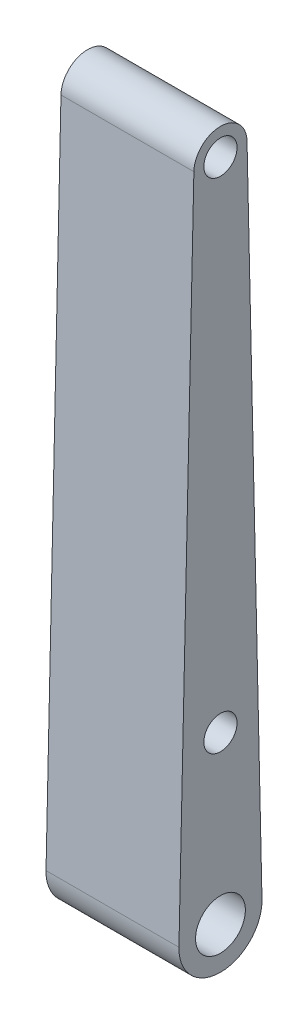
ISO-10303-21;
HEADER;
FILE_DESCRIPTION(('STEP AP214'),'2;1');
FILE_NAME('part.step','',(''),(''),'','','');
FILE_SCHEMA(('AUTOMOTIVE_DESIGN { 1 0 10303 214 1 1 1 1 }'));
ENDSEC;
DATA;
#1=APPLICATION_CONTEXT('core data for automotive mechanical design processes');
#2=APPLICATION_PROTOCOL_DEFINITION('international standard','automotive_design',2000,#1);
#3=PRODUCT_CONTEXT('',#1,'mechanical');
#4=PRODUCT('Part','Part','',(#3));
#5=PRODUCT_RELATED_PRODUCT_CATEGORY('part','',(#4));
#6=PRODUCT_DEFINITION_FORMATION('','',#4);
#7=PRODUCT_DEFINITION_CONTEXT('part definition',#1,'design');
#8=PRODUCT_DEFINITION('design','',#6,#7);
#9=PRODUCT_DEFINITION_SHAPE('','',#8);
#10=(LENGTH_UNIT() NAMED_UNIT(*) SI_UNIT(.MILLI.,.METRE.));
#11=(NAMED_UNIT(*) PLANE_ANGLE_UNIT() SI_UNIT($,.RADIAN.));
#12=(NAMED_UNIT(*) SI_UNIT($,.STERADIAN.) SOLID_ANGLE_UNIT());
#13=UNCERTAINTY_MEASURE_WITH_UNIT(LENGTH_MEASURE(1.E-05),#10,'distance_accuracy_value','');
#14=(GEOMETRIC_REPRESENTATION_CONTEXT(3) GLOBAL_UNCERTAINTY_ASSIGNED_CONTEXT((#13)) GLOBAL_UNIT_ASSIGNED_CONTEXT((#10,
#11,#12)) REPRESENTATION_CONTEXT('',''));
#15=CARTESIAN_POINT('',(0.,0.,0.));
#16=DIRECTION('',(0.,0.,1.));
#17=DIRECTION('',(1.,0.,0.));
#18=AXIS2_PLACEMENT_3D('',#15,#16,#17);
#19=CARTESIAN_POINT('',(12.7,0.,0.));
#20=DIRECTION('',(1.,0.,0.));
#21=DIRECTION('',(0.,0.,-1.));
#22=AXIS2_PLACEMENT_3D('',#19,#20,#21);
#23=PLANE('',#22);
#24=CARTESIAN_POINT('',(12.7,31.75,0.));
#25=DIRECTION('',(1.,0.,0.));
#26=DIRECTION('',(0.,0.,-1.));
#27=AXIS2_PLACEMENT_3D('',#24,#25,#26);
#28=CIRCLE('',#27,3.175);
#29=CARTESIAN_POINT('',(12.7,31.75,-3.175));
#30=VERTEX_POINT('',#29);
#31=EDGE_CURVE('E154',#30,#30,#28,.T.);
#32=ORIENTED_EDGE('',*,*,#31,.F.);
#33=EDGE_LOOP('',(#32));
#34=FACE_BOUND('',#33,.T.);
#35=CARTESIAN_POINT('',(12.7,127.,0.));
#36=DIRECTION('',(1.,0.,0.));
#37=DIRECTION('',(0.,0.,-1.));
#38=AXIS2_PLACEMENT_3D('',#35,#36,#37);
#39=CIRCLE('',#38,3.175);
#40=CARTESIAN_POINT('',(12.7,127.,-3.175));
#41=VERTEX_POINT('',#40);
#42=EDGE_CURVE('E146',#41,#41,#39,.T.);
#43=ORIENTED_EDGE('',*,*,#42,.F.);
#44=EDGE_LOOP('',(#43));
#45=FACE_BOUND('',#44,.T.);
#46=CARTESIAN_POINT('',(12.7,0.,0.));
#47=DIRECTION('',(1.,0.,0.));
#48=DIRECTION('',(0.,0.,-1.));
#49=AXIS2_PLACEMENT_3D('',#46,#47,#48);
#50=CIRCLE('',#49,7.9375);
#51=CARTESIAN_POINT('',(12.7,0.17859375,7.93549056596131));
#52=VERTEX_POINT('',#51);
#53=CARTESIAN_POINT('',(12.7,0.17859375,-7.93549056596131));
#54=VERTEX_POINT('',#53);
#55=EDGE_CURVE('E100',#52,#54,#50,.T.);
#56=ORIENTED_EDGE('',*,*,#55,.T.);
#57=DIRECTION('',(0.,0.999746842955756,0.0225));
#58=VECTOR('',#57,1.);
#59=CARTESIAN_POINT('',(12.7,127.1143,-5.07871396221524));
#60=LINE('',#59,#58);
#61=CARTESIAN_POINT('',(12.7,127.1143,-5.07871396221524));
#62=VERTEX_POINT('',#61);
#63=EDGE_CURVE('E95',#54,#62,#60,.T.);
#64=ORIENTED_EDGE('',*,*,#63,.T.);
#65=CARTESIAN_POINT('',(12.7,127.,0.));
#66=DIRECTION('',(1.,0.,0.));
#67=DIRECTION('',(0.,0.,-1.));
#68=AXIS2_PLACEMENT_3D('',#65,#66,#67);
#69=CIRCLE('',#68,5.08);
#70=CARTESIAN_POINT('',(12.7,127.1143,5.07871396221524));
#71=VERTEX_POINT('',#70);
#72=EDGE_CURVE('E98',#62,#71,#69,.T.);
#73=ORIENTED_EDGE('',*,*,#72,.T.);
#74=DIRECTION('',(0.,-0.999746842955756,0.0225));
#75=VECTOR('',#74,1.);
#76=CARTESIAN_POINT('',(12.7,127.1143,5.07871396221524));
#77=LINE('',#76,#75);
#78=EDGE_CURVE('E65',#71,#52,#77,.T.);
#79=ORIENTED_EDGE('',*,*,#78,.T.);
#80=EDGE_LOOP('',(#56,#64,#73,#79));
#81=FACE_BOUND('',#80,.T.);
#82=CARTESIAN_POINT('',(12.7,0.,0.));
#83=DIRECTION('',(1.,0.,0.));
#84=DIRECTION('',(0.,0.,-1.));
#85=AXIS2_PLACEMENT_3D('',#82,#83,#84);
#86=CIRCLE('',#85,4.7625);
#87=CARTESIAN_POINT('',(12.7,0.,-4.7625));
#88=VERTEX_POINT('',#87);
#89=EDGE_CURVE('E120',#88,#88,#86,.T.);
#90=ORIENTED_EDGE('',*,*,#89,.F.);
#91=EDGE_LOOP('',(#90));
#92=FACE_BOUND('',#91,.T.);
#93=ADVANCED_FACE('F47',(#34,#45,#81,#92),#23,.T.);
#94=CARTESIAN_POINT('',(-12.7,0.,0.));
#95=DIRECTION('',(1.,0.,0.));
#96=DIRECTION('',(0.,0.,-1.));
#97=AXIS2_PLACEMENT_3D('',#94,#95,#96);
#98=PLANE('',#97);
#99=CARTESIAN_POINT('',(-12.7,31.75,0.));
#100=DIRECTION('',(1.,0.,0.));
#101=DIRECTION('',(0.,0.,-1.));
#102=AXIS2_PLACEMENT_3D('',#99,#100,#101);
#103=CIRCLE('',#102,3.175);
#104=CARTESIAN_POINT('',(-12.7,31.75,-3.175));
#105=VERTEX_POINT('',#104);
#106=EDGE_CURVE('E142',#105,#105,#103,.T.);
#107=ORIENTED_EDGE('',*,*,#106,.T.);
#108=EDGE_LOOP('',(#107));
#109=FACE_BOUND('',#108,.T.);
#110=CARTESIAN_POINT('',(-12.7,127.,0.));
#111=DIRECTION('',(1.,0.,0.));
#112=DIRECTION('',(0.,0.,-1.));
#113=AXIS2_PLACEMENT_3D('',#110,#111,#112);
#114=CIRCLE('',#113,3.175);
#115=CARTESIAN_POINT('',(-12.7,127.,-3.175));
#116=VERTEX_POINT('',#115);
#117=EDGE_CURVE('E150',#116,#116,#114,.T.);
#118=ORIENTED_EDGE('',*,*,#117,.T.);
#119=EDGE_LOOP('',(#118));
#120=FACE_BOUND('',#119,.T.);
#121=CARTESIAN_POINT('',(-12.7,0.,0.));
#122=DIRECTION('',(1.,0.,0.));
#123=DIRECTION('',(0.,0.,-1.));
#124=AXIS2_PLACEMENT_3D('',#121,#122,#123);
#125=CIRCLE('',#124,7.9375);
#126=CARTESIAN_POINT('',(-12.7,0.17859375,7.93549056596131));
#127=VERTEX_POINT('',#126);
#128=CARTESIAN_POINT('',(-12.7,0.17859375,-7.93549056596131));
#129=VERTEX_POINT('',#128);
#130=EDGE_CURVE('E116',#127,#129,#125,.T.);
#131=ORIENTED_EDGE('',*,*,#130,.F.);
#132=DIRECTION('',(0.,-0.999746842955756,0.0225));
#133=VECTOR('',#132,1.);
#134=CARTESIAN_POINT('',(-12.7,127.1143,5.07871396221524));
#135=LINE('',#134,#133);
#136=CARTESIAN_POINT('',(-12.7,127.1143,5.07871396221524));
#137=VERTEX_POINT('',#136);
#138=EDGE_CURVE('E88',#137,#127,#135,.T.);
#139=ORIENTED_EDGE('',*,*,#138,.F.);
#140=CARTESIAN_POINT('',(-12.7,127.,0.));
#141=DIRECTION('',(1.,0.,0.));
#142=DIRECTION('',(0.,0.,-1.));
#143=AXIS2_PLACEMENT_3D('',#140,#141,#142);
#144=CIRCLE('',#143,5.08);
#145=CARTESIAN_POINT('',(-12.7,127.1143,-5.07871396221524));
#146=VERTEX_POINT('',#145);
#147=EDGE_CURVE('E82',#146,#137,#144,.T.);
#148=ORIENTED_EDGE('',*,*,#147,.F.);
#149=DIRECTION('',(0.,0.999746842955756,0.0225));
#150=VECTOR('',#149,1.);
#151=CARTESIAN_POINT('',(-12.7,127.1143,-5.07871396221524));
#152=LINE('',#151,#150);
#153=EDGE_CURVE('E105',#129,#146,#152,.T.);
#154=ORIENTED_EDGE('',*,*,#153,.F.);
#155=EDGE_LOOP('',(#131,#139,#148,#154));
#156=FACE_BOUND('',#155,.T.);
#157=CARTESIAN_POINT('',(-12.7,0.,0.));
#158=DIRECTION('',(1.,0.,0.));
#159=DIRECTION('',(0.,0.,-1.));
#160=AXIS2_PLACEMENT_3D('',#157,#158,#159);
#161=CIRCLE('',#160,4.7625);
#162=CARTESIAN_POINT('',(-12.7,0.,-4.7625));
#163=VERTEX_POINT('',#162);
#164=EDGE_CURVE('E138',#163,#163,#161,.T.);
#165=ORIENTED_EDGE('',*,*,#164,.T.);
#166=EDGE_LOOP('',(#165));
#167=FACE_BOUND('',#166,.T.);
#168=ADVANCED_FACE('F133',(#109,#120,#156,#167),#98,.F.);
#169=CARTESIAN_POINT('',(12.7,0.,0.));
#170=DIRECTION('',(-1.,0.,0.));
#171=DIRECTION('',(0.,0.,1.));
#172=AXIS2_PLACEMENT_3D('',#169,#170,#171);
#173=CYLINDRICAL_SURFACE('',#172,7.9375);
#174=ORIENTED_EDGE('',*,*,#130,.T.);
#175=DIRECTION('',(-1.,0.,0.));
#176=VECTOR('',#175,1.);
#177=CARTESIAN_POINT('',(12.7,0.17859375,-7.93549056596131));
#178=LINE('',#177,#176);
#179=EDGE_CURVE('E11',#54,#129,#178,.T.);
#180=ORIENTED_EDGE('',*,*,#179,.F.);
#181=ORIENTED_EDGE('',*,*,#55,.F.);
#182=DIRECTION('',(-1.,0.,0.));
#183=VECTOR('',#182,1.);
#184=CARTESIAN_POINT('',(12.7,0.17859375,7.93549056596131));
#185=LINE('',#184,#183);
#186=EDGE_CURVE('E112',#52,#127,#185,.T.);
#187=ORIENTED_EDGE('',*,*,#186,.T.);
#188=EDGE_LOOP('',(#174,#180,#181,#187));
#189=FACE_BOUND('',#188,.T.);
#190=ADVANCED_FACE('F49',(#189),#173,.T.);
#191=CARTESIAN_POINT('',(12.7,127.1143,-5.07871396221524));
#192=DIRECTION('',(0.,-0.0225,0.999746842955756));
#193=DIRECTION('',(0.,-0.999746842955756,-0.0225));
#194=AXIS2_PLACEMENT_3D('',#191,#192,#193);
#195=PLANE('',#194);
#196=ORIENTED_EDGE('',*,*,#153,.T.);
#197=DIRECTION('',(-1.,0.,0.));
#198=VECTOR('',#197,1.);
#199=CARTESIAN_POINT('',(12.7,127.1143,-5.07871396221524));
#200=LINE('',#199,#198);
#201=EDGE_CURVE('E57',#62,#146,#200,.T.);
#202=ORIENTED_EDGE('',*,*,#201,.F.);
#203=ORIENTED_EDGE('',*,*,#63,.F.);
#204=ORIENTED_EDGE('',*,*,#179,.T.);
#205=EDGE_LOOP('',(#196,#202,#203,#204));
#206=FACE_BOUND('',#205,.T.);
#207=ADVANCED_FACE('F104',(#206),#195,.F.);
#208=CARTESIAN_POINT('',(12.7,127.,0.));
#209=DIRECTION('',(-1.,0.,0.));
#210=DIRECTION('',(0.,0.,1.));
#211=AXIS2_PLACEMENT_3D('',#208,#209,#210);
#212=CYLINDRICAL_SURFACE('',#211,5.08);
#213=ORIENTED_EDGE('',*,*,#147,.T.);
#214=DIRECTION('',(-1.,0.,0.));
#215=VECTOR('',#214,1.);
#216=CARTESIAN_POINT('',(12.7,127.1143,5.07871396221524));
#217=LINE('',#216,#215);
#218=EDGE_CURVE('E107',#71,#137,#217,.T.);
#219=ORIENTED_EDGE('',*,*,#218,.F.);
#220=ORIENTED_EDGE('',*,*,#72,.F.);
#221=ORIENTED_EDGE('',*,*,#201,.T.);
#222=EDGE_LOOP('',(#213,#219,#220,#221));
#223=FACE_BOUND('',#222,.T.);
#224=ADVANCED_FACE('F108',(#223),#212,.T.);
#225=CARTESIAN_POINT('',(12.7,127.1143,5.07871396221524));
#226=DIRECTION('',(0.,-0.0225,-0.999746842955756));
#227=DIRECTION('',(0.,0.999746842955756,-0.0225));
#228=AXIS2_PLACEMENT_3D('',#225,#226,#227);
#229=PLANE('',#228);
#230=ORIENTED_EDGE('',*,*,#138,.T.);
#231=ORIENTED_EDGE('',*,*,#186,.F.);
#232=ORIENTED_EDGE('',*,*,#78,.F.);
#233=ORIENTED_EDGE('',*,*,#218,.T.);
#234=EDGE_LOOP('',(#230,#231,#232,#233));
#235=FACE_BOUND('',#234,.T.);
#236=ADVANCED_FACE('F130',(#235),#229,.F.);
#237=CARTESIAN_POINT('',(12.7,0.,0.));
#238=DIRECTION('',(-1.,0.,0.));
#239=DIRECTION('',(0.,0.,1.));
#240=AXIS2_PLACEMENT_3D('',#237,#238,#239);
#241=CYLINDRICAL_SURFACE('',#240,4.7625);
#242=ORIENTED_EDGE('',*,*,#89,.T.);
#243=EDGE_LOOP('',(#242));
#244=FACE_BOUND('',#243,.T.);
#245=ORIENTED_EDGE('',*,*,#164,.F.);
#246=EDGE_LOOP('',(#245));
#247=FACE_BOUND('',#246,.T.);
#248=ADVANCED_FACE('F177',(#244,#247),#241,.F.);
#249=CARTESIAN_POINT('',(-12.7,127.,0.));
#250=DIRECTION('',(1.,0.,0.));
#251=DIRECTION('',(0.,0.,-1.));
#252=AXIS2_PLACEMENT_3D('',#249,#250,#251);
#253=CYLINDRICAL_SURFACE('',#252,3.175);
#254=ORIENTED_EDGE('',*,*,#117,.F.);
#255=EDGE_LOOP('',(#254));
#256=FACE_BOUND('',#255,.T.);
#257=ORIENTED_EDGE('',*,*,#42,.T.);
#258=EDGE_LOOP('',(#257));
#259=FACE_BOUND('',#258,.T.);
#260=ADVANCED_FACE('F167',(#256,#259),#253,.F.);
#261=CARTESIAN_POINT('',(-12.7,31.75,0.));
#262=DIRECTION('',(1.,0.,0.));
#263=DIRECTION('',(0.,0.,-1.));
#264=AXIS2_PLACEMENT_3D('',#261,#262,#263);
#265=CYLINDRICAL_SURFACE('',#264,3.175);
#266=ORIENTED_EDGE('',*,*,#106,.F.);
#267=EDGE_LOOP('',(#266));
#268=FACE_BOUND('',#267,.T.);
#269=ORIENTED_EDGE('',*,*,#31,.T.);
#270=EDGE_LOOP('',(#269));
#271=FACE_BOUND('',#270,.T.);
#272=ADVANCED_FACE('F164',(#268,#271),#265,.F.);
#273=CLOSED_SHELL('',(#93,#168,#190,#207,#224,#236,#248,#260,#272));
#274=MANIFOLD_SOLID_BREP('B2',#273);
#275=ADVANCED_BREP_SHAPE_REPRESENTATION('',(#18,#274),#14);
#276=SHAPE_DEFINITION_REPRESENTATION(#9,#275);
ENDSEC;
END-ISO-10303-21;
